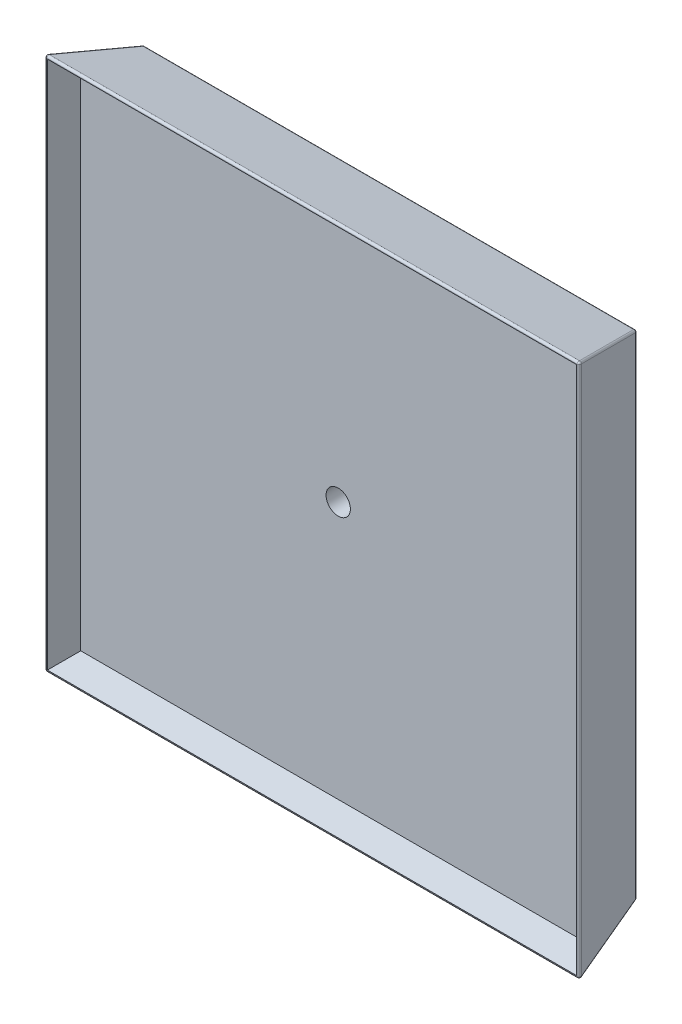
ISO-10303-21;
HEADER;
FILE_DESCRIPTION(('STEP AP214'),'2;1');
FILE_NAME('part.step','',(''),(''),'','','');
FILE_SCHEMA(('AUTOMOTIVE_DESIGN { 1 0 10303 214 1 1 1 1 }'));
ENDSEC;
DATA;
#1=APPLICATION_CONTEXT('core data for automotive mechanical design processes');
#2=APPLICATION_PROTOCOL_DEFINITION('international standard','automotive_design',2000,#1);
#3=PRODUCT_CONTEXT('',#1,'mechanical');
#4=PRODUCT('Part','Part','',(#3));
#5=PRODUCT_RELATED_PRODUCT_CATEGORY('part','',(#4));
#6=PRODUCT_DEFINITION_FORMATION('','',#4);
#7=PRODUCT_DEFINITION_CONTEXT('part definition',#1,'design');
#8=PRODUCT_DEFINITION('design','',#6,#7);
#9=PRODUCT_DEFINITION_SHAPE('','',#8);
#10=(LENGTH_UNIT() NAMED_UNIT(*) SI_UNIT(.MILLI.,.METRE.));
#11=(NAMED_UNIT(*) PLANE_ANGLE_UNIT() SI_UNIT($,.RADIAN.));
#12=(NAMED_UNIT(*) SI_UNIT($,.STERADIAN.) SOLID_ANGLE_UNIT());
#13=UNCERTAINTY_MEASURE_WITH_UNIT(LENGTH_MEASURE(1.E-05),#10,'distance_accuracy_value','');
#14=(GEOMETRIC_REPRESENTATION_CONTEXT(3) GLOBAL_UNCERTAINTY_ASSIGNED_CONTEXT((#13)) GLOBAL_UNIT_ASSIGNED_CONTEXT((#10,
#11,#12)) REPRESENTATION_CONTEXT('',''));
#15=CARTESIAN_POINT('',(0.,0.,0.));
#16=DIRECTION('',(0.,0.,1.));
#17=DIRECTION('',(1.,0.,0.));
#18=AXIS2_PLACEMENT_3D('',#15,#16,#17);
#19=CARTESIAN_POINT('',(526.262083641573,-526.262083641573,3.));
#20=DIRECTION('',(0.965925826289068,0.,-0.258819045102521));
#21=DIRECTION('',(-0.258819045102521,0.,-0.965925826289068));
#22=AXIS2_PLACEMENT_3D('',#19,#20,#21);
#23=PLANE('',#22);
#24=DIRECTION('',(0.,1.,0.));
#25=VECTOR('',#24,1.);
#26=CARTESIAN_POINT('',(526.262083641573,-526.262083641573,3.));
#27=LINE('',#26,#25);
#28=CARTESIAN_POINT('',(526.262083641573,-526.262083641573,3.));
#29=VERTEX_POINT('',#28);
#30=CARTESIAN_POINT('',(526.262083641573,-23.7379163584267,3.));
#31=VERTEX_POINT('',#30);
#32=EDGE_CURVE('E92',#29,#31,#27,.T.);
#33=ORIENTED_EDGE('',*,*,#32,.T.);
#34=DIRECTION('',(-0.250562807085732,-0.250562807085732,-0.935113126531029));
#35=VECTOR('',#34,1.);
#36=CARTESIAN_POINT('',(526.262083641573,-23.7379163584267,3.));
#37=LINE('',#36,#35);
#38=CARTESIAN_POINT('',(539.65954326313,-10.3404567368706,53.));
#39=VERTEX_POINT('',#38);
#40=EDGE_CURVE('E12',#39,#31,#37,.T.);
#41=ORIENTED_EDGE('',*,*,#40,.F.);
#42=DIRECTION('',(0.,-1.,0.));
#43=VECTOR('',#42,1.);
#44=CARTESIAN_POINT('',(539.65954326313,-526.262083641573,53.));
#45=LINE('',#44,#43);
#46=CARTESIAN_POINT('',(539.65954326313,-539.659543263129,53.));
#47=VERTEX_POINT('',#46);
#48=EDGE_CURVE('E111',#47,#39,#45,.F.);
#49=ORIENTED_EDGE('',*,*,#48,.F.);
#50=DIRECTION('',(-0.250562807085732,0.250562807085732,-0.935113126531029));
#51=VECTOR('',#50,1.);
#52=CARTESIAN_POINT('',(526.262083641573,-526.262083641573,3.));
#53=LINE('',#52,#51);
#54=EDGE_CURVE('E103',#47,#29,#53,.T.);
#55=ORIENTED_EDGE('',*,*,#54,.T.);
#56=EDGE_LOOP('',(#33,#41,#49,#55));
#57=FACE_BOUND('',#56,.T.);
#58=ADVANCED_FACE('F45',(#57),#23,.T.);
#59=CARTESIAN_POINT('',(526.262083641573,-23.7379163584267,3.));
#60=DIRECTION('',(0.,0.965925826289068,-0.258819045102521));
#61=DIRECTION('',(0.,0.258819045102521,0.965925826289068));
#62=AXIS2_PLACEMENT_3D('',#59,#60,#61);
#63=PLANE('',#62);
#64=DIRECTION('',(-1.,0.,0.));
#65=VECTOR('',#64,1.);
#66=CARTESIAN_POINT('',(526.262083641573,-23.7379163584267,3.));
#67=LINE('',#66,#65);
#68=CARTESIAN_POINT('',(23.7379163584268,-23.7379163584267,3.));
#69=VERTEX_POINT('',#68);
#70=EDGE_CURVE('E88',#31,#69,#67,.T.);
#71=ORIENTED_EDGE('',*,*,#70,.T.);
#72=DIRECTION('',(0.250562807085732,-0.250562807085732,-0.935113126531029));
#73=VECTOR('',#72,1.);
#74=CARTESIAN_POINT('',(55.2872480701152,-55.2872480701151,-114.743708892865));
#75=LINE('',#74,#73);
#76=CARTESIAN_POINT('',(10.3404567368706,-10.3404567368706,53.));
#77=VERTEX_POINT('',#76);
#78=EDGE_CURVE('E54',#77,#69,#75,.T.);
#79=ORIENTED_EDGE('',*,*,#78,.F.);
#80=DIRECTION('',(1.,0.,0.));
#81=VECTOR('',#80,1.);
#82=CARTESIAN_POINT('',(526.262083641573,-10.3404567368706,53.));
#83=LINE('',#82,#81);
#84=EDGE_CURVE('E99',#39,#77,#83,.F.);
#85=ORIENTED_EDGE('',*,*,#84,.F.);
#86=ORIENTED_EDGE('',*,*,#40,.T.);
#87=EDGE_LOOP('',(#71,#79,#85,#86));
#88=FACE_BOUND('',#87,.T.);
#89=ADVANCED_FACE('F47',(#88),#63,.T.);
#90=CARTESIAN_POINT('',(23.7379163584268,-526.262083641573,3.));
#91=DIRECTION('',(-0.965925826289068,0.,-0.258819045102521));
#92=DIRECTION('',(-0.258819045102521,0.,0.965925826289068));
#93=AXIS2_PLACEMENT_3D('',#90,#91,#92);
#94=PLANE('',#93);
#95=DIRECTION('',(0.,-1.,0.));
#96=VECTOR('',#95,1.);
#97=CARTESIAN_POINT('',(23.7379163584268,-526.262083641573,3.));
#98=LINE('',#97,#96);
#99=CARTESIAN_POINT('',(23.7379163584268,-526.262083641573,3.));
#100=VERTEX_POINT('',#99);
#101=EDGE_CURVE('E93',#69,#100,#98,.T.);
#102=ORIENTED_EDGE('',*,*,#101,.T.);
#103=DIRECTION('',(0.250562807085732,0.250562807085732,-0.935113126531029));
#104=VECTOR('',#103,1.);
#105=CARTESIAN_POINT('',(55.2872480701153,-494.712751929885,-114.743708892865));
#106=LINE('',#105,#104);
#107=CARTESIAN_POINT('',(10.3404567368706,-539.659543263129,53.));
#108=VERTEX_POINT('',#107);
#109=EDGE_CURVE('E114',#108,#100,#106,.T.);
#110=ORIENTED_EDGE('',*,*,#109,.F.);
#111=DIRECTION('',(0.,1.,0.));
#112=VECTOR('',#111,1.);
#113=CARTESIAN_POINT('',(10.3404567368706,-526.262083641573,53.));
#114=LINE('',#113,#112);
#115=EDGE_CURVE('E67',#77,#108,#114,.F.);
#116=ORIENTED_EDGE('',*,*,#115,.F.);
#117=ORIENTED_EDGE('',*,*,#78,.T.);
#118=EDGE_LOOP('',(#102,#110,#116,#117));
#119=FACE_BOUND('',#118,.T.);
#120=ADVANCED_FACE('F122',(#119),#94,.T.);
#121=CARTESIAN_POINT('',(526.262083641573,-526.262083641573,3.));
#122=DIRECTION('',(0.,-0.965925826289068,-0.258819045102521));
#123=DIRECTION('',(0.,0.258819045102521,-0.965925826289068));
#124=AXIS2_PLACEMENT_3D('',#121,#122,#123);
#125=PLANE('',#124);
#126=DIRECTION('',(1.,0.,0.));
#127=VECTOR('',#126,1.);
#128=CARTESIAN_POINT('',(526.262083641573,-526.262083641573,3.));
#129=LINE('',#128,#127);
#130=EDGE_CURVE('E110',#100,#29,#129,.T.);
#131=ORIENTED_EDGE('',*,*,#130,.T.);
#132=ORIENTED_EDGE('',*,*,#54,.F.);
#133=DIRECTION('',(-1.,0.,0.));
#134=VECTOR('',#133,1.);
#135=CARTESIAN_POINT('',(526.262083641573,-539.659543263129,53.));
#136=LINE('',#135,#134);
#137=EDGE_CURVE('E62',#108,#47,#136,.F.);
#138=ORIENTED_EDGE('',*,*,#137,.F.);
#139=ORIENTED_EDGE('',*,*,#109,.T.);
#140=EDGE_LOOP('',(#131,#132,#138,#139));
#141=FACE_BOUND('',#140,.T.);
#142=ADVANCED_FACE('F124',(#141),#125,.T.);
#143=CARTESIAN_POINT('',(0.,0.,53.));
#144=DIRECTION('',(0.,0.,1.));
#145=DIRECTION('',(1.,0.,0.));
#146=AXIS2_PLACEMENT_3D('',#143,#144,#145);
#147=PLANE('',#146);
#148=CARTESIAN_POINT('',(274.970589370448,-274.970589370448,53.));
#149=DIRECTION('',(0.,0.,1.));
#150=DIRECTION('',(1.,0.,0.));
#151=AXIS2_PLACEMENT_3D('',#148,#149,#150);
#152=CIRCLE('',#151,12.5);
#153=CARTESIAN_POINT('',(287.470589370448,-274.970589370448,53.));
#154=VERTEX_POINT('',#153);
#155=EDGE_CURVE('E104',#154,#154,#152,.T.);
#156=ORIENTED_EDGE('',*,*,#155,.F.);
#157=EDGE_LOOP('',(#156));
#158=FACE_BOUND('',#157,.T.);
#159=ORIENTED_EDGE('',*,*,#48,.T.);
#160=ORIENTED_EDGE('',*,*,#84,.T.);
#161=ORIENTED_EDGE('',*,*,#115,.T.);
#162=ORIENTED_EDGE('',*,*,#137,.T.);
#163=EDGE_LOOP('',(#159,#160,#161,#162));
#164=FACE_BOUND('',#163,.T.);
#165=ADVANCED_FACE('F120',(#158,#164),#147,.T.);
#166=CARTESIAN_POINT('',(0.,0.,3.));
#167=DIRECTION('',(0.,0.,1.));
#168=DIRECTION('',(1.,0.,0.));
#169=AXIS2_PLACEMENT_3D('',#166,#167,#168);
#170=PLANE('',#169);
#171=CARTESIAN_POINT('',(274.970589370448,-274.970589370448,3.));
#172=DIRECTION('',(0.,0.,1.));
#173=DIRECTION('',(1.,0.,0.));
#174=AXIS2_PLACEMENT_3D('',#171,#172,#173);
#175=CIRCLE('',#174,12.5);
#176=CARTESIAN_POINT('',(287.470589370448,-274.970589370448,3.));
#177=VERTEX_POINT('',#176);
#178=EDGE_CURVE('E49',#177,#177,#175,.T.);
#179=ORIENTED_EDGE('',*,*,#178,.T.);
#180=EDGE_LOOP('',(#179));
#181=FACE_BOUND('',#180,.T.);
#182=ORIENTED_EDGE('',*,*,#32,.F.);
#183=ORIENTED_EDGE('',*,*,#130,.F.);
#184=ORIENTED_EDGE('',*,*,#101,.F.);
#185=ORIENTED_EDGE('',*,*,#70,.F.);
#186=EDGE_LOOP('',(#182,#183,#184,#185));
#187=FACE_BOUND('',#186,.T.);
#188=ADVANCED_FACE('F89',(#181,#187),#170,.F.);
#189=CARTESIAN_POINT('',(274.970589370448,-274.970589370448,80.));
#190=DIRECTION('',(0.,0.,-1.));
#191=DIRECTION('',(-1.,0.,0.));
#192=AXIS2_PLACEMENT_3D('',#189,#190,#191);
#193=CYLINDRICAL_SURFACE('',#192,12.5);
#194=ORIENTED_EDGE('',*,*,#155,.T.);
#195=EDGE_LOOP('',(#194));
#196=FACE_BOUND('',#195,.T.);
#197=ORIENTED_EDGE('',*,*,#178,.F.);
#198=EDGE_LOOP('',(#197));
#199=FACE_BOUND('',#198,.T.);
#200=ADVANCED_FACE('F140',(#196,#199),#193,.F.);
#201=CLOSED_SHELL('',(#58,#89,#120,#142,#165,#188,#200));
#202=MANIFOLD_SOLID_BREP('B2',#201);
#203=CARTESIAN_POINT('',(0.,0.,80.));
#204=DIRECTION('',(0.,0.,1.));
#205=DIRECTION('',(1.,0.,0.));
#206=AXIS2_PLACEMENT_3D('',#203,#204,#205);
#207=PLANE('',#206);
#208=DIRECTION('',(1.,0.,0.));
#209=VECTOR('',#208,1.);
#210=CARTESIAN_POINT('',(0.,-2.60645074568241,80.));
#211=LINE('',#210,#209);
#212=CARTESIAN_POINT('',(547.393549254318,-2.60645074568241,80.));
#213=VERTEX_POINT('',#212);
#214=CARTESIAN_POINT('',(2.60645074568241,-2.60645074568241,80.));
#215=VERTEX_POINT('',#214);
#216=EDGE_CURVE('E344',#213,#215,#211,.F.);
#217=ORIENTED_EDGE('',*,*,#216,.T.);
#218=DIRECTION('',(0.,1.,0.));
#219=VECTOR('',#218,1.);
#220=CARTESIAN_POINT('',(2.60645074568248,-550.,80.));
#221=LINE('',#220,#219);
#222=CARTESIAN_POINT('',(2.60645074568248,-547.393549254318,80.));
#223=VERTEX_POINT('',#222);
#224=EDGE_CURVE('E351',#215,#223,#221,.F.);
#225=ORIENTED_EDGE('',*,*,#224,.T.);
#226=DIRECTION('',(-1.,0.,0.));
#227=VECTOR('',#226,1.);
#228=CARTESIAN_POINT('',(550.,-547.393549254318,80.));
#229=LINE('',#228,#227);
#230=CARTESIAN_POINT('',(547.393549254318,-547.393549254318,80.));
#231=VERTEX_POINT('',#230);
#232=EDGE_CURVE('E349',#223,#231,#229,.F.);
#233=ORIENTED_EDGE('',*,*,#232,.T.);
#234=DIRECTION('',(0.,-1.,0.));
#235=VECTOR('',#234,1.);
#236=CARTESIAN_POINT('',(547.393549254318,1.10496167620623E-13,80.));
#237=LINE('',#236,#235);
#238=EDGE_CURVE('E346',#231,#213,#237,.F.);
#239=ORIENTED_EDGE('',*,*,#238,.T.);
#240=EDGE_LOOP('',(#217,#225,#233,#239));
#241=FACE_BOUND('',#240,.T.);
#242=DIRECTION('',(0.,-1.,0.));
#243=VECTOR('',#242,1.);
#244=CARTESIAN_POINT('',(3.10582854123025,0.,80.));
#245=LINE('',#244,#243);
#246=CARTESIAN_POINT('',(3.10582854123032,-546.89417145877,80.));
#247=VERTEX_POINT('',#246);
#248=CARTESIAN_POINT('',(3.10582854123025,-3.10582854123025,80.));
#249=VERTEX_POINT('',#248);
#250=EDGE_CURVE('E320',#247,#249,#245,.F.);
#251=ORIENTED_EDGE('',*,*,#250,.T.);
#252=DIRECTION('',(1.,0.,0.));
#253=VECTOR('',#252,1.);
#254=CARTESIAN_POINT('',(0.,-3.10582854123025,80.));
#255=LINE('',#254,#253);
#256=CARTESIAN_POINT('',(546.89417145877,-3.10582854123025,80.));
#257=VERTEX_POINT('',#256);
#258=EDGE_CURVE('E331',#249,#257,#255,.T.);
#259=ORIENTED_EDGE('',*,*,#258,.T.);
#260=DIRECTION('',(0.,-1.,0.));
#261=VECTOR('',#260,1.);
#262=CARTESIAN_POINT('',(546.89417145877,0.,80.));
#263=LINE('',#262,#261);
#264=CARTESIAN_POINT('',(546.89417145877,-546.89417145877,80.));
#265=VERTEX_POINT('',#264);
#266=EDGE_CURVE('E332',#257,#265,#263,.T.);
#267=ORIENTED_EDGE('',*,*,#266,.T.);
#268=DIRECTION('',(-1.,0.,0.));
#269=VECTOR('',#268,1.);
#270=CARTESIAN_POINT('',(0.,-546.89417145877,80.));
#271=LINE('',#270,#269);
#272=EDGE_CURVE('E207',#247,#265,#271,.F.);
#273=ORIENTED_EDGE('',*,*,#272,.F.);
#274=EDGE_LOOP('',(#251,#259,#267,#273));
#275=FACE_BOUND('',#274,.T.);
#276=ADVANCED_FACE('F190',(#241,#275),#207,.T.);
#277=CARTESIAN_POINT('',(0.,0.,80.));
#278=DIRECTION('',(-0.965925826289068,0.,-0.258819045102521));
#279=DIRECTION('',(-0.258819045102521,0.,0.965925826289068));
#280=AXIS2_PLACEMENT_3D('',#277,#278,#279);
#281=PLANE('',#280);
#282=DIRECTION('',(0.,-1.,0.));
#283=VECTOR('',#282,1.);
#284=CARTESIAN_POINT('',(21.0387377178697,0.,1.48236190979496));
#285=LINE('',#284,#283);
#286=CARTESIAN_POINT('',(21.0387377178697,-22.9705893704478,1.48236190979496));
#287=VERTEX_POINT('',#286);
#288=CARTESIAN_POINT('',(21.0387377178697,-527.029410629552,1.48236190979496));
#289=VERTEX_POINT('',#288);
#290=EDGE_CURVE('E356',#287,#289,#285,.T.);
#291=ORIENTED_EDGE('',*,*,#290,.T.);
#292=DIRECTION('',(-0.250562807085732,-0.250562807085732,0.935113126531029));
#293=VECTOR('',#292,1.);
#294=CARTESIAN_POINT('',(34.4086611919721,-513.65948715545,-48.4148717888628));
#295=LINE('',#294,#293);
#296=CARTESIAN_POINT('',(0.674599093104343,-547.393549254318,77.482361909795));
#297=VERTEX_POINT('',#296);
#298=EDGE_CURVE('E361',#289,#297,#295,.T.);
#299=ORIENTED_EDGE('',*,*,#298,.T.);
#300=DIRECTION('',(0.,-1.,0.));
#301=VECTOR('',#300,1.);
#302=CARTESIAN_POINT('',(0.674599093104276,0.,77.482361909795));
#303=LINE('',#302,#301);
#304=CARTESIAN_POINT('',(0.674599093104277,-2.60645074568241,77.482361909795));
#305=VERTEX_POINT('',#304);
#306=EDGE_CURVE('E358',#297,#305,#303,.F.);
#307=ORIENTED_EDGE('',*,*,#306,.T.);
#308=DIRECTION('',(0.250562807085732,-0.250562807085732,-0.935113126531029));
#309=VECTOR('',#308,1.);
#310=CARTESIAN_POINT('',(21.3146504243869,-23.246502076965,0.452641670618783));
#311=LINE('',#310,#309);
#312=EDGE_CURVE('E354',#305,#287,#311,.T.);
#313=ORIENTED_EDGE('',*,*,#312,.T.);
#314=EDGE_LOOP('',(#291,#299,#307,#313));
#315=FACE_BOUND('',#314,.T.);
#316=ADVANCED_FACE('F519',(#315),#281,.T.);
#317=CARTESIAN_POINT('',(0.,-550.,80.));
#318=DIRECTION('',(0.,-0.965925826289068,-0.258819045102521));
#319=DIRECTION('',(0.,0.258819045102521,-0.965925826289068));
#320=AXIS2_PLACEMENT_3D('',#317,#318,#319);
#321=PLANE('',#320);
#322=DIRECTION('',(1.,0.,0.));
#323=VECTOR('',#322,1.);
#324=CARTESIAN_POINT('',(0.,-549.325400906896,77.4823619097949));
#325=LINE('',#324,#323);
#326=CARTESIAN_POINT('',(547.393549254318,-549.325400906896,77.4823619097949));
#327=VERTEX_POINT('',#326);
#328=CARTESIAN_POINT('',(2.60645074568248,-549.325400906896,77.4823619097949));
#329=VERTEX_POINT('',#328);
#330=EDGE_CURVE('E376',#327,#329,#325,.F.);
#331=ORIENTED_EDGE('',*,*,#330,.T.);
#332=DIRECTION('',(-0.250562807085732,-0.250562807085732,0.935113126531029));
#333=VECTOR('',#332,1.);
#334=CARTESIAN_POINT('',(1.81056668247523,-550.121284970103,80.4526416706188));
#335=LINE('',#334,#333);
#336=CARTESIAN_POINT('',(22.9705893704479,-528.96126228213,1.48236190979494));
#337=VERTEX_POINT('',#336);
#338=EDGE_CURVE('E378',#329,#337,#335,.F.);
#339=ORIENTED_EDGE('',*,*,#338,.T.);
#340=DIRECTION('',(1.,0.,0.));
#341=VECTOR('',#340,1.);
#342=CARTESIAN_POINT('',(0.,-528.96126228213,1.48236190979495));
#343=LINE('',#342,#341);
#344=CARTESIAN_POINT('',(527.029410629552,-528.96126228213,1.48236190979493));
#345=VERTEX_POINT('',#344);
#346=EDGE_CURVE('E374',#337,#345,#343,.T.);
#347=ORIENTED_EDGE('',*,*,#346,.T.);
#348=DIRECTION('',(-0.250562807085732,0.250562807085732,-0.935113126531029));
#349=VECTOR('',#348,1.);
#350=CARTESIAN_POINT('',(548.189433317525,-550.121284970103,80.4526416706188));
#351=LINE('',#350,#349);
#352=EDGE_CURVE('E372',#345,#327,#351,.F.);
#353=ORIENTED_EDGE('',*,*,#352,.T.);
#354=EDGE_LOOP('',(#331,#339,#347,#353));
#355=FACE_BOUND('',#354,.T.);
#356=ADVANCED_FACE('F524',(#355),#321,.T.);
#357=CARTESIAN_POINT('',(550.,0.,80.));
#358=DIRECTION('',(0.965925826289068,0.,-0.258819045102521));
#359=DIRECTION('',(-0.258819045102521,0.,-0.965925826289068));
#360=AXIS2_PLACEMENT_3D('',#357,#358,#359);
#361=PLANE('',#360);
#362=DIRECTION('',(0.,-1.,0.));
#363=VECTOR('',#362,1.);
#364=CARTESIAN_POINT('',(549.325400906896,0.,77.4823619097949));
#365=LINE('',#364,#363);
#366=CARTESIAN_POINT('',(549.325400906896,-2.60645074568241,77.4823619097949));
#367=VERTEX_POINT('',#366);
#368=CARTESIAN_POINT('',(549.325400906896,-547.393549254317,77.4823619097949));
#369=VERTEX_POINT('',#368);
#370=EDGE_CURVE('E385',#367,#369,#365,.T.);
#371=ORIENTED_EDGE('',*,*,#370,.T.);
#372=DIRECTION('',(0.250562807085732,-0.250562807085732,0.935113126531029));
#373=VECTOR('',#372,1.);
#374=CARTESIAN_POINT('',(528.685349575613,-526.753497923035,0.452641670618839));
#375=LINE('',#374,#373);
#376=CARTESIAN_POINT('',(528.961262282131,-527.029410629552,1.48236190979491));
#377=VERTEX_POINT('',#376);
#378=EDGE_CURVE('E387',#369,#377,#375,.F.);
#379=ORIENTED_EDGE('',*,*,#378,.T.);
#380=DIRECTION('',(0.,-1.,0.));
#381=VECTOR('',#380,1.);
#382=CARTESIAN_POINT('',(528.96126228213,-21.4359353944899,1.48236190979491));
#383=LINE('',#382,#381);
#384=CARTESIAN_POINT('',(528.96126228213,-22.9705893704478,1.48236190979491));
#385=VERTEX_POINT('',#384);
#386=EDGE_CURVE('E383',#377,#385,#383,.F.);
#387=ORIENTED_EDGE('',*,*,#386,.T.);
#388=DIRECTION('',(-0.250562807085732,-0.250562807085732,-0.935113126531029));
#389=VECTOR('',#388,1.);
#390=CARTESIAN_POINT('',(550.121284970103,-1.81056668247515,80.4526416706188));
#391=LINE('',#390,#389);
#392=EDGE_CURVE('E381',#385,#367,#391,.F.);
#393=ORIENTED_EDGE('',*,*,#392,.T.);
#394=EDGE_LOOP('',(#371,#379,#387,#393));
#395=FACE_BOUND('',#394,.T.);
#396=ADVANCED_FACE('F498',(#395),#361,.T.);
#397=CARTESIAN_POINT('',(0.,0.,80.));
#398=DIRECTION('',(0.,0.965925826289068,-0.258819045102521));
#399=DIRECTION('',(0.,0.258819045102521,0.965925826289068));
#400=AXIS2_PLACEMENT_3D('',#397,#398,#399);
#401=PLANE('',#400);
#402=DIRECTION('',(1.,0.,0.));
#403=VECTOR('',#402,1.);
#404=CARTESIAN_POINT('',(0.,-0.674599093104276,77.482361909795));
#405=LINE('',#404,#403);
#406=CARTESIAN_POINT('',(2.60645074568241,-0.674599093104276,77.482361909795));
#407=VERTEX_POINT('',#406);
#408=CARTESIAN_POINT('',(547.393549254317,-0.674599093104276,77.482361909795));
#409=VERTEX_POINT('',#408);
#410=EDGE_CURVE('E199',#407,#409,#405,.T.);
#411=ORIENTED_EDGE('',*,*,#410,.T.);
#412=DIRECTION('',(-0.250562807085732,-0.250562807085732,-0.935113126531029));
#413=VECTOR('',#412,1.);
#414=CARTESIAN_POINT('',(513.65948715545,-34.408661191972,-48.4148717888627));
#415=LINE('',#414,#413);
#416=CARTESIAN_POINT('',(527.029410629552,-21.0387377178697,1.48236190979496));
#417=VERTEX_POINT('',#416);
#418=EDGE_CURVE('E43',#409,#417,#415,.T.);
#419=ORIENTED_EDGE('',*,*,#418,.T.);
#420=DIRECTION('',(1.,0.,0.));
#421=VECTOR('',#420,1.);
#422=CARTESIAN_POINT('',(21.4359353944899,-21.0387377178697,1.48236190979496));
#423=LINE('',#422,#421);
#424=CARTESIAN_POINT('',(22.9705893704478,-21.0387377178697,1.48236190979496));
#425=VERTEX_POINT('',#424);
#426=EDGE_CURVE('E390',#417,#425,#423,.F.);
#427=ORIENTED_EDGE('',*,*,#426,.T.);
#428=DIRECTION('',(-0.250562807085732,0.250562807085732,0.935113126531029));
#429=VECTOR('',#428,1.);
#430=CARTESIAN_POINT('',(1.81056668247516,0.121284970102978,80.4526416706188));
#431=LINE('',#430,#429);
#432=EDGE_CURVE('E392',#425,#407,#431,.T.);
#433=ORIENTED_EDGE('',*,*,#432,.T.);
#434=EDGE_LOOP('',(#411,#419,#427,#433));
#435=FACE_BOUND('',#434,.T.);
#436=ADVANCED_FACE('F472',(#435),#401,.T.);
#437=CARTESIAN_POINT('',(0.,0.,0.));
#438=DIRECTION('',(0.,0.,1.));
#439=DIRECTION('',(1.,0.,0.));
#440=AXIS2_PLACEMENT_3D('',#437,#438,#439);
#441=PLANE('',#440);
#442=CARTESIAN_POINT('',(274.970589370448,-274.970589370448,0.));
#443=DIRECTION('',(0.,0.,1.));
#444=DIRECTION('',(1.,0.,0.));
#445=AXIS2_PLACEMENT_3D('',#442,#443,#444);
#446=CIRCLE('',#445,12.5);
#447=CARTESIAN_POINT('',(287.470589370448,-274.970589370448,0.));
#448=VERTEX_POINT('',#447);
#449=EDGE_CURVE('E804',#448,#448,#446,.T.);
#450=ORIENTED_EDGE('',*,*,#449,.T.);
#451=EDGE_LOOP('',(#450));
#452=FACE_BOUND('',#451,.T.);
#453=DIRECTION('',(-1.,0.,0.));
#454=VECTOR('',#453,1.);
#455=CARTESIAN_POINT('',(0.,-527.029410629552,0.));
#456=LINE('',#455,#454);
#457=CARTESIAN_POINT('',(527.029410629552,-527.029410629552,0.));
#458=VERTEX_POINT('',#457);
#459=CARTESIAN_POINT('',(22.9705893704479,-527.029410629552,0.));
#460=VERTEX_POINT('',#459);
#461=EDGE_CURVE('E367',#458,#460,#456,.T.);
#462=ORIENTED_EDGE('',*,*,#461,.T.);
#463=DIRECTION('',(0.,1.,0.));
#464=VECTOR('',#463,1.);
#465=CARTESIAN_POINT('',(22.9705893704478,0.,0.));
#466=LINE('',#465,#464);
#467=CARTESIAN_POINT('',(22.9705893704478,-22.9705893704478,0.));
#468=VERTEX_POINT('',#467);
#469=EDGE_CURVE('E369',#460,#468,#466,.T.);
#470=ORIENTED_EDGE('',*,*,#469,.T.);
#471=DIRECTION('',(1.,0.,0.));
#472=VECTOR('',#471,1.);
#473=CARTESIAN_POINT('',(528.56406460551,-22.9705893704478,0.));
#474=LINE('',#473,#472);
#475=CARTESIAN_POINT('',(527.029410629552,-22.9705893704478,0.));
#476=VERTEX_POINT('',#475);
#477=EDGE_CURVE('E363',#468,#476,#474,.T.);
#478=ORIENTED_EDGE('',*,*,#477,.T.);
#479=DIRECTION('',(0.,-1.,0.));
#480=VECTOR('',#479,1.);
#481=CARTESIAN_POINT('',(527.029410629552,-528.56406460551,0.));
#482=LINE('',#481,#480);
#483=EDGE_CURVE('E365',#476,#458,#482,.T.);
#484=ORIENTED_EDGE('',*,*,#483,.T.);
#485=EDGE_LOOP('',(#462,#470,#478,#484));
#486=FACE_BOUND('',#485,.T.);
#487=ADVANCED_FACE('F511',(#452,#486),#441,.F.);
#488=CARTESIAN_POINT('',(527.029410629552,1.06385488424646E-13,2.));
#489=DIRECTION('',(0.,1.,0.));
#490=DIRECTION('',(-1.,0.,0.));
#491=AXIS2_PLACEMENT_3D('',#488,#489,#490);
#492=CYLINDRICAL_SURFACE('',#491,2.);
#493=CARTESIAN_POINT('',(527.029410629552,-22.9705893704478,1.99999999999996));
#494=DIRECTION('',(0.,1.,0.));
#495=DIRECTION('',(0.,0.,1.));
#496=AXIS2_PLACEMENT_3D('',#493,#494,#495);
#497=CIRCLE('',#496,2.);
#498=EDGE_CURVE('E347',#385,#476,#497,.T.);
#499=ORIENTED_EDGE('',*,*,#498,.F.);
#500=ORIENTED_EDGE('',*,*,#386,.F.);
#501=CARTESIAN_POINT('',(527.029410629552,-527.029410629552,2.));
#502=DIRECTION('',(1.14938745233719E-13,-1.,0.));
#503=DIRECTION('',(1.,1.14938745233719E-13,0.));
#504=AXIS2_PLACEMENT_3D('',#501,#502,#503);
#505=CIRCLE('',#504,2.);
#506=EDGE_CURVE('E455',#458,#377,#505,.T.);
#507=ORIENTED_EDGE('',*,*,#506,.F.);
#508=ORIENTED_EDGE('',*,*,#483,.F.);
#509=EDGE_LOOP('',(#499,#500,#507,#508));
#510=FACE_BOUND('',#509,.T.);
#511=ADVANCED_FACE('F192',(#510),#492,.T.);
#512=CARTESIAN_POINT('',(527.029410629552,-22.9705893704478,1.99999999999999));
#513=DIRECTION('',(0.,0.,1.));
#514=DIRECTION('',(1.,0.,0.));
#515=AXIS2_PLACEMENT_3D('',#512,#513,#514);
#516=SPHERICAL_SURFACE('',#515,2.);
#517=CARTESIAN_POINT('',(527.029410629552,-22.9705893704478,2.00000000000001));
#518=DIRECTION('',(-0.250562807085756,-0.250562807085731,-0.935113126531023));
#519=DIRECTION('',(-0.965925826289062,0.,0.258819045102546));
#520=AXIS2_PLACEMENT_3D('',#517,#518,#519);
#521=CIRCLE('',#520,2.);
#522=EDGE_CURVE('E449',#385,#417,#521,.F.);
#523=ORIENTED_EDGE('',*,*,#522,.F.);
#524=ORIENTED_EDGE('',*,*,#498,.T.);
#525=CARTESIAN_POINT('',(527.029410629552,-22.9705893704478,2.));
#526=DIRECTION('',(1.,0.,0.));
#527=DIRECTION('',(0.,1.,0.));
#528=AXIS2_PLACEMENT_3D('',#525,#526,#527);
#529=CIRCLE('',#528,2.);
#530=EDGE_CURVE('E452',#417,#476,#529,.F.);
#531=ORIENTED_EDGE('',*,*,#530,.F.);
#532=EDGE_LOOP('',(#523,#524,#531));
#533=FACE_BOUND('',#532,.T.);
#534=ADVANCED_FACE('F462',(#533),#516,.T.);
#535=CARTESIAN_POINT('',(527.029410629552,-527.029410629552,1.99999999999998));
#536=DIRECTION('',(0.,0.,1.));
#537=DIRECTION('',(1.,0.,0.));
#538=AXIS2_PLACEMENT_3D('',#535,#536,#537);
#539=SPHERICAL_SURFACE('',#538,2.);
#540=CARTESIAN_POINT('',(527.029410629552,-527.029410629552,1.99999999999999));
#541=DIRECTION('',(1.,0.,0.));
#542=DIRECTION('',(0.,0.,-1.));
#543=AXIS2_PLACEMENT_3D('',#540,#541,#542);
#544=CIRCLE('',#543,2.);
#545=EDGE_CURVE('E444',#458,#345,#544,.F.);
#546=ORIENTED_EDGE('',*,*,#545,.F.);
#547=ORIENTED_EDGE('',*,*,#506,.T.);
#548=CARTESIAN_POINT('',(527.029410629552,-527.029410629552,1.99999999999994));
#549=DIRECTION('',(-0.250562807085734,0.250562807085691,-0.93511312653104));
#550=DIRECTION('',(-0.965925826289068,0.,0.258819045102521));
#551=AXIS2_PLACEMENT_3D('',#548,#549,#550);
#552=CIRCLE('',#551,2.);
#553=EDGE_CURVE('E447',#345,#377,#552,.F.);
#554=ORIENTED_EDGE('',*,*,#553,.F.);
#555=EDGE_LOOP('',(#546,#547,#554));
#556=FACE_BOUND('',#555,.T.);
#557=ADVANCED_FACE('F508',(#556),#539,.T.);
#558=CARTESIAN_POINT('',(0.,-22.9705893704478,2.));
#559=DIRECTION('',(-1.,0.,0.));
#560=DIRECTION('',(0.,0.,1.));
#561=AXIS2_PLACEMENT_3D('',#558,#559,#560);
#562=CYLINDRICAL_SURFACE('',#561,2.);
#563=ORIENTED_EDGE('',*,*,#530,.T.);
#564=ORIENTED_EDGE('',*,*,#477,.F.);
#565=CARTESIAN_POINT('',(22.9705893704478,-22.9705893704478,2.));
#566=DIRECTION('',(-1.,0.,0.));
#567=DIRECTION('',(0.,0.,1.));
#568=AXIS2_PLACEMENT_3D('',#565,#566,#567);
#569=CIRCLE('',#568,2.);
#570=EDGE_CURVE('E439',#425,#468,#569,.T.);
#571=ORIENTED_EDGE('',*,*,#570,.F.);
#572=ORIENTED_EDGE('',*,*,#426,.F.);
#573=EDGE_LOOP('',(#563,#564,#571,#572));
#574=FACE_BOUND('',#573,.T.);
#575=ADVANCED_FACE('F469',(#574),#562,.T.);
#576=CARTESIAN_POINT('',(513.65948715545,-36.3405128445501,-47.8972336986576));
#577=DIRECTION('',(-0.250562807085732,-0.250562807085732,-0.935113126531029));
#578=DIRECTION('',(0.,0.965925826289068,-0.258819045102521));
#579=AXIS2_PLACEMENT_3D('',#576,#577,#578);
#580=CYLINDRICAL_SURFACE('',#579,2.);
#581=ORIENTED_EDGE('',*,*,#522,.T.);
#582=ORIENTED_EDGE('',*,*,#418,.F.);
#583=CARTESIAN_POINT('',(547.393549254318,-2.60645074568241,78.));
#584=DIRECTION('',(0.250562807085729,0.250562807085744,0.935113126531027));
#585=DIRECTION('',(0.,-0.965925826289065,0.258819045102534));
#586=AXIS2_PLACEMENT_3D('',#583,#584,#585);
#587=CIRCLE('',#586,2.);
#588=EDGE_CURVE('E436',#367,#409,#587,.T.);
#589=ORIENTED_EDGE('',*,*,#588,.F.);
#590=ORIENTED_EDGE('',*,*,#392,.F.);
#591=EDGE_LOOP('',(#581,#582,#589,#590));
#592=FACE_BOUND('',#591,.T.);
#593=ADVANCED_FACE('F476',(#592),#580,.T.);
#594=CARTESIAN_POINT('',(547.393549254318,0.,78.));
#595=DIRECTION('',(0.,-1.,0.));
#596=DIRECTION('',(1.,0.,0.));
#597=AXIS2_PLACEMENT_3D('',#594,#595,#596);
#598=CYLINDRICAL_SURFACE('',#597,2.);
#599=CARTESIAN_POINT('',(547.393549254318,-547.393549254317,78.));
#600=DIRECTION('',(0.,-1.,-1.11022302462515E-13));
#601=DIRECTION('',(0.,1.11022302462515E-13,-1.));
#602=AXIS2_PLACEMENT_3D('',#599,#600,#601);
#603=CIRCLE('',#602,2.);
#604=EDGE_CURVE('E430',#369,#231,#603,.T.);
#605=ORIENTED_EDGE('',*,*,#604,.F.);
#606=ORIENTED_EDGE('',*,*,#370,.F.);
#607=CARTESIAN_POINT('',(547.393549254318,-2.60645074568241,78.));
#608=DIRECTION('',(0.,1.,0.));
#609=DIRECTION('',(-1.,0.,0.));
#610=AXIS2_PLACEMENT_3D('',#607,#608,#609);
#611=CIRCLE('',#610,2.);
#612=EDGE_CURVE('E433',#213,#367,#611,.T.);
#613=ORIENTED_EDGE('',*,*,#612,.F.);
#614=ORIENTED_EDGE('',*,*,#238,.F.);
#615=EDGE_LOOP('',(#605,#606,#613,#614));
#616=FACE_BOUND('',#615,.T.);
#617=ADVANCED_FACE('F495',(#616),#598,.T.);
#618=CARTESIAN_POINT('',(513.65948715545,-513.65948715545,-47.8972336986577));
#619=DIRECTION('',(-0.250562807085732,0.250562807085732,-0.935113126531029));
#620=DIRECTION('',(-0.965925826289068,0.,0.258819045102521));
#621=AXIS2_PLACEMENT_3D('',#618,#619,#620);
#622=CYLINDRICAL_SURFACE('',#621,2.);
#623=ORIENTED_EDGE('',*,*,#553,.T.);
#624=ORIENTED_EDGE('',*,*,#378,.F.);
#625=CARTESIAN_POINT('',(547.393549254318,-547.393549254318,78.));
#626=DIRECTION('',(0.250562807085757,-0.250562807085728,0.935113126531024));
#627=DIRECTION('',(0.965925826289061,0.,-0.258819045102546));
#628=AXIS2_PLACEMENT_3D('',#625,#626,#627);
#629=CIRCLE('',#628,2.);
#630=EDGE_CURVE('E427',#327,#369,#629,.T.);
#631=ORIENTED_EDGE('',*,*,#630,.F.);
#632=ORIENTED_EDGE('',*,*,#352,.F.);
#633=EDGE_LOOP('',(#623,#624,#631,#632));
#634=FACE_BOUND('',#633,.T.);
#635=ADVANCED_FACE('F501',(#634),#622,.T.);
#636=CARTESIAN_POINT('',(0.,-527.029410629552,2.));
#637=DIRECTION('',(-1.,0.,0.));
#638=DIRECTION('',(0.,0.,1.));
#639=AXIS2_PLACEMENT_3D('',#636,#637,#638);
#640=CYLINDRICAL_SURFACE('',#639,2.);
#641=ORIENTED_EDGE('',*,*,#545,.T.);
#642=ORIENTED_EDGE('',*,*,#346,.F.);
#643=CARTESIAN_POINT('',(22.9705893704479,-527.029410629552,2.));
#644=DIRECTION('',(-1.,0.,0.));
#645=DIRECTION('',(0.,-1.,0.));
#646=AXIS2_PLACEMENT_3D('',#643,#644,#645);
#647=CIRCLE('',#646,2.);
#648=EDGE_CURVE('E424',#460,#337,#647,.T.);
#649=ORIENTED_EDGE('',*,*,#648,.F.);
#650=ORIENTED_EDGE('',*,*,#461,.F.);
#651=EDGE_LOOP('',(#641,#642,#649,#650));
#652=FACE_BOUND('',#651,.T.);
#653=ADVANCED_FACE('F580',(#652),#640,.T.);
#654=CARTESIAN_POINT('',(22.9705893704478,0.,2.));
#655=DIRECTION('',(0.,1.,0.));
#656=DIRECTION('',(-1.,0.,0.));
#657=AXIS2_PLACEMENT_3D('',#654,#655,#656);
#658=CYLINDRICAL_SURFACE('',#657,2.);
#659=CARTESIAN_POINT('',(22.9705893704478,-22.9705893704478,2.));
#660=DIRECTION('',(0.,1.,0.));
#661=DIRECTION('',(-1.,0.,0.));
#662=AXIS2_PLACEMENT_3D('',#659,#660,#661);
#663=CIRCLE('',#662,2.);
#664=EDGE_CURVE('E441',#468,#287,#663,.T.);
#665=ORIENTED_EDGE('',*,*,#664,.F.);
#666=ORIENTED_EDGE('',*,*,#469,.F.);
#667=CARTESIAN_POINT('',(22.9705893704479,-527.029410629552,2.));
#668=DIRECTION('',(0.,-1.,0.));
#669=DIRECTION('',(0.,0.,-1.));
#670=AXIS2_PLACEMENT_3D('',#667,#668,#669);
#671=CIRCLE('',#670,2.);
#672=EDGE_CURVE('E421',#289,#460,#671,.T.);
#673=ORIENTED_EDGE('',*,*,#672,.F.);
#674=ORIENTED_EDGE('',*,*,#290,.F.);
#675=EDGE_LOOP('',(#665,#666,#673,#674));
#676=FACE_BOUND('',#675,.T.);
#677=ADVANCED_FACE('F576',(#676),#658,.T.);
#678=CARTESIAN_POINT('',(22.9705893704478,-22.9705893704478,2.));
#679=DIRECTION('',(0.,0.,1.));
#680=DIRECTION('',(1.,0.,0.));
#681=AXIS2_PLACEMENT_3D('',#678,#679,#680);
#682=SPHERICAL_SURFACE('',#681,2.);
#683=ORIENTED_EDGE('',*,*,#570,.T.);
#684=ORIENTED_EDGE('',*,*,#664,.T.);
#685=CARTESIAN_POINT('',(22.9705893704478,-22.9705893704478,2.));
#686=DIRECTION('',(0.250562807085732,-0.250562807085733,-0.935113126531029));
#687=DIRECTION('',(0.,0.965925826289068,-0.258819045102522));
#688=AXIS2_PLACEMENT_3D('',#685,#686,#687);
#689=CIRCLE('',#688,2.);
#690=EDGE_CURVE('E418',#425,#287,#689,.F.);
#691=ORIENTED_EDGE('',*,*,#690,.F.);
#692=EDGE_LOOP('',(#683,#684,#691));
#693=FACE_BOUND('',#692,.T.);
#694=ADVANCED_FACE('F573',(#693),#682,.T.);
#695=CARTESIAN_POINT('',(547.393549254318,-2.60645074568241,78.));
#696=DIRECTION('',(0.,0.,1.));
#697=DIRECTION('',(1.,0.,0.));
#698=AXIS2_PLACEMENT_3D('',#695,#696,#697);
#699=SPHERICAL_SURFACE('',#698,2.);
#700=ORIENTED_EDGE('',*,*,#612,.T.);
#701=ORIENTED_EDGE('',*,*,#588,.T.);
#702=CARTESIAN_POINT('',(547.393549254317,-2.60645074568241,78.));
#703=DIRECTION('',(1.,0.,0.));
#704=DIRECTION('',(0.,0.,-1.));
#705=AXIS2_PLACEMENT_3D('',#702,#703,#704);
#706=CIRCLE('',#705,2.);
#707=EDGE_CURVE('E415',#213,#409,#706,.F.);
#708=ORIENTED_EDGE('',*,*,#707,.F.);
#709=EDGE_LOOP('',(#700,#701,#708));
#710=FACE_BOUND('',#709,.T.);
#711=ADVANCED_FACE('F479',(#710),#699,.T.);
#712=CARTESIAN_POINT('',(547.393549254318,-547.393549254318,78.));
#713=DIRECTION('',(0.,0.,1.));
#714=DIRECTION('',(1.,0.,0.));
#715=AXIS2_PLACEMENT_3D('',#712,#713,#714);
#716=SPHERICAL_SURFACE('',#715,2.);
#717=ORIENTED_EDGE('',*,*,#630,.T.);
#718=ORIENTED_EDGE('',*,*,#604,.T.);
#719=CARTESIAN_POINT('',(547.393549254318,-547.393549254318,78.));
#720=DIRECTION('',(1.,0.,0.));
#721=DIRECTION('',(0.,0.,-1.));
#722=AXIS2_PLACEMENT_3D('',#719,#720,#721);
#723=CIRCLE('',#722,2.);
#724=EDGE_CURVE('E412',#327,#231,#723,.F.);
#725=ORIENTED_EDGE('',*,*,#724,.F.);
#726=EDGE_LOOP('',(#717,#718,#725));
#727=FACE_BOUND('',#726,.T.);
#728=ADVANCED_FACE('F566',(#727),#716,.T.);
#729=CARTESIAN_POINT('',(22.9705893704479,-527.029410629552,2.));
#730=DIRECTION('',(0.,0.,1.));
#731=DIRECTION('',(1.,0.,0.));
#732=AXIS2_PLACEMENT_3D('',#729,#730,#731);
#733=SPHERICAL_SURFACE('',#732,2.);
#734=ORIENTED_EDGE('',*,*,#672,.T.);
#735=ORIENTED_EDGE('',*,*,#648,.T.);
#736=CARTESIAN_POINT('',(22.9705893704479,-527.029410629552,1.99999999999998));
#737=DIRECTION('',(0.250562807085721,0.250562807085732,-0.935113126531032));
#738=DIRECTION('',(0.,0.965925826289068,0.258819045102521));
#739=AXIS2_PLACEMENT_3D('',#736,#737,#738);
#740=CIRCLE('',#739,2.);
#741=EDGE_CURVE('E410',#289,#337,#740,.F.);
#742=ORIENTED_EDGE('',*,*,#741,.F.);
#743=EDGE_LOOP('',(#734,#735,#742));
#744=FACE_BOUND('',#743,.T.);
#745=ADVANCED_FACE('F562',(#744),#733,.T.);
#746=CARTESIAN_POINT('',(1.81056668247516,-1.81056668247516,80.9702797608238));
#747=DIRECTION('',(0.250562807085732,-0.250562807085732,-0.935113126531029));
#748=DIRECTION('',(-0.965925826289068,0.,-0.258819045102521));
#749=AXIS2_PLACEMENT_3D('',#746,#747,#748);
#750=CYLINDRICAL_SURFACE('',#749,2.);
#751=ORIENTED_EDGE('',*,*,#690,.T.);
#752=ORIENTED_EDGE('',*,*,#312,.F.);
#753=CARTESIAN_POINT('',(2.60645074568241,-2.60645074568241,78.));
#754=DIRECTION('',(-0.250562807085731,0.25056280708573,0.93511312653103));
#755=DIRECTION('',(0.965925826289069,0.,0.25881904510252));
#756=AXIS2_PLACEMENT_3D('',#753,#754,#755);
#757=CIRCLE('',#756,2.);
#758=EDGE_CURVE('E407',#407,#305,#757,.T.);
#759=ORIENTED_EDGE('',*,*,#758,.F.);
#760=ORIENTED_EDGE('',*,*,#432,.F.);
#761=EDGE_LOOP('',(#751,#752,#759,#760));
#762=FACE_BOUND('',#761,.T.);
#763=ADVANCED_FACE('F559',(#762),#750,.T.);
#764=CARTESIAN_POINT('',(0.,-2.60645074568241,78.));
#765=DIRECTION('',(1.,0.,0.));
#766=DIRECTION('',(0.,0.,-1.));
#767=AXIS2_PLACEMENT_3D('',#764,#765,#766);
#768=CYLINDRICAL_SURFACE('',#767,2.);
#769=ORIENTED_EDGE('',*,*,#707,.T.);
#770=ORIENTED_EDGE('',*,*,#410,.F.);
#771=CARTESIAN_POINT('',(2.60645074568241,-2.60645074568241,78.));
#772=DIRECTION('',(-1.,0.,0.));
#773=DIRECTION('',(0.,-1.,0.));
#774=AXIS2_PLACEMENT_3D('',#771,#772,#773);
#775=CIRCLE('',#774,2.);
#776=EDGE_CURVE('E404',#215,#407,#775,.T.);
#777=ORIENTED_EDGE('',*,*,#776,.F.);
#778=ORIENTED_EDGE('',*,*,#216,.F.);
#779=EDGE_LOOP('',(#769,#770,#777,#778));
#780=FACE_BOUND('',#779,.T.);
#781=ADVANCED_FACE('F483',(#780),#768,.T.);
#782=CARTESIAN_POINT('',(0.,-547.393549254318,78.));
#783=DIRECTION('',(1.,0.,0.));
#784=DIRECTION('',(0.,0.,-1.));
#785=AXIS2_PLACEMENT_3D('',#782,#783,#784);
#786=CYLINDRICAL_SURFACE('',#785,2.);
#787=ORIENTED_EDGE('',*,*,#724,.T.);
#788=ORIENTED_EDGE('',*,*,#232,.F.);
#789=CARTESIAN_POINT('',(2.60645074568248,-547.393549254318,78.));
#790=DIRECTION('',(-1.,0.,0.));
#791=DIRECTION('',(0.,0.,1.));
#792=AXIS2_PLACEMENT_3D('',#789,#790,#791);
#793=CIRCLE('',#792,2.);
#794=EDGE_CURVE('E401',#329,#223,#793,.T.);
#795=ORIENTED_EDGE('',*,*,#794,.F.);
#796=ORIENTED_EDGE('',*,*,#330,.F.);
#797=EDGE_LOOP('',(#787,#788,#795,#796));
#798=FACE_BOUND('',#797,.T.);
#799=ADVANCED_FACE('F552',(#798),#786,.T.);
#800=CARTESIAN_POINT('',(1.81056668247522,-548.189433317525,80.9702797608238));
#801=DIRECTION('',(0.250562807085732,0.250562807085732,-0.935113126531029));
#802=DIRECTION('',(-0.965925826289068,0.,-0.258819045102521));
#803=AXIS2_PLACEMENT_3D('',#800,#801,#802);
#804=CYLINDRICAL_SURFACE('',#803,2.);
#805=ORIENTED_EDGE('',*,*,#741,.T.);
#806=ORIENTED_EDGE('',*,*,#338,.F.);
#807=CARTESIAN_POINT('',(2.60645074568248,-547.393549254318,78.));
#808=DIRECTION('',(-0.25056280708573,-0.25056280708573,0.93511312653103));
#809=DIRECTION('',(0.965925826289069,0.,0.258819045102519));
#810=AXIS2_PLACEMENT_3D('',#807,#808,#809);
#811=CIRCLE('',#810,2.);
#812=EDGE_CURVE('E398',#297,#329,#811,.T.);
#813=ORIENTED_EDGE('',*,*,#812,.F.);
#814=ORIENTED_EDGE('',*,*,#298,.F.);
#815=EDGE_LOOP('',(#805,#806,#813,#814));
#816=FACE_BOUND('',#815,.T.);
#817=ADVANCED_FACE('F548',(#816),#804,.T.);
#818=CARTESIAN_POINT('',(2.60645074568241,-2.60645074568241,78.));
#819=DIRECTION('',(0.,0.,1.));
#820=DIRECTION('',(1.,0.,0.));
#821=AXIS2_PLACEMENT_3D('',#818,#819,#820);
#822=SPHERICAL_SURFACE('',#821,2.);
#823=ORIENTED_EDGE('',*,*,#776,.T.);
#824=ORIENTED_EDGE('',*,*,#758,.T.);
#825=CARTESIAN_POINT('',(2.60645074568241,-2.60645074568241,78.));
#826=DIRECTION('',(0.,1.,0.));
#827=DIRECTION('',(0.,0.,1.));
#828=AXIS2_PLACEMENT_3D('',#825,#826,#827);
#829=CIRCLE('',#828,2.);
#830=EDGE_CURVE('E396',#215,#305,#829,.F.);
#831=ORIENTED_EDGE('',*,*,#830,.F.);
#832=EDGE_LOOP('',(#823,#824,#831));
#833=FACE_BOUND('',#832,.T.);
#834=ADVANCED_FACE('F544',(#833),#822,.T.);
#835=CARTESIAN_POINT('',(2.60645074568248,-547.393549254318,78.));
#836=DIRECTION('',(0.,0.,1.));
#837=DIRECTION('',(1.,0.,0.));
#838=AXIS2_PLACEMENT_3D('',#835,#836,#837);
#839=SPHERICAL_SURFACE('',#838,2.);
#840=ORIENTED_EDGE('',*,*,#812,.T.);
#841=ORIENTED_EDGE('',*,*,#794,.T.);
#842=CARTESIAN_POINT('',(2.60645074568248,-547.393549254318,78.));
#843=DIRECTION('',(0.,-1.,0.));
#844=DIRECTION('',(0.,0.,-1.));
#845=AXIS2_PLACEMENT_3D('',#842,#843,#844);
#846=CIRCLE('',#845,2.);
#847=EDGE_CURVE('E339',#297,#223,#846,.F.);
#848=ORIENTED_EDGE('',*,*,#847,.F.);
#849=EDGE_LOOP('',(#840,#841,#848));
#850=FACE_BOUND('',#849,.T.);
#851=ADVANCED_FACE('F540',(#850),#839,.T.);
#852=CARTESIAN_POINT('',(2.60645074568241,0.,78.));
#853=DIRECTION('',(0.,-1.,0.));
#854=DIRECTION('',(1.,0.,0.));
#855=AXIS2_PLACEMENT_3D('',#852,#853,#854);
#856=CYLINDRICAL_SURFACE('',#855,2.);
#857=ORIENTED_EDGE('',*,*,#830,.T.);
#858=ORIENTED_EDGE('',*,*,#306,.F.);
#859=ORIENTED_EDGE('',*,*,#847,.T.);
#860=ORIENTED_EDGE('',*,*,#224,.F.);
#861=EDGE_LOOP('',(#857,#858,#859,#860));
#862=FACE_BOUND('',#861,.T.);
#863=ADVANCED_FACE('F537',(#862),#856,.T.);
#864=CARTESIAN_POINT('',(2.8977774788672,0.,80.7764571353076));
#865=DIRECTION('',(-0.965925826289068,0.,-0.258819045102521));
#866=DIRECTION('',(-0.258819045102521,0.,0.965925826289068));
#867=AXIS2_PLACEMENT_3D('',#864,#865,#866);
#868=PLANE('',#867);
#869=DIRECTION('',(0.,-1.,0.));
#870=VECTOR('',#869,1.);
#871=CARTESIAN_POINT('',(23.7379163584268,0.,3.));
#872=LINE('',#871,#870);
#873=CARTESIAN_POINT('',(23.7379163584268,-526.262083641573,3.));
#874=VERTEX_POINT('',#873);
#875=CARTESIAN_POINT('',(23.7379163584268,-23.7379163584267,3.));
#876=VERTEX_POINT('',#875);
#877=EDGE_CURVE('E304',#874,#876,#872,.F.);
#878=ORIENTED_EDGE('',*,*,#877,.T.);
#879=DIRECTION('',(-0.250562807085732,0.250562807085732,0.935113126531029));
#880=VECTOR('',#879,1.);
#881=CARTESIAN_POINT('',(2.71585002371274,-2.71585002371274,81.4554196412357));
#882=LINE('',#881,#880);
#883=EDGE_CURVE('E329',#249,#876,#882,.F.);
#884=ORIENTED_EDGE('',*,*,#883,.F.);
#885=ORIENTED_EDGE('',*,*,#250,.F.);
#886=DIRECTION('',(0.250562807085732,0.250562807085732,-0.935113126531029));
#887=VECTOR('',#886,1.);
#888=CARTESIAN_POINT('',(2.7158500237128,-547.284149976287,81.4554196412357));
#889=LINE('',#888,#887);
#890=EDGE_CURVE('E317',#247,#874,#889,.T.);
#891=ORIENTED_EDGE('',*,*,#890,.T.);
#892=EDGE_LOOP('',(#878,#884,#885,#891));
#893=FACE_BOUND('',#892,.T.);
#894=ADVANCED_FACE('F318',(#893),#868,.F.);
#895=CARTESIAN_POINT('',(0.,-547.102222521133,80.7764571353076));
#896=DIRECTION('',(0.,-0.965925826289068,-0.258819045102521));
#897=DIRECTION('',(0.,0.258819045102521,-0.965925826289068));
#898=AXIS2_PLACEMENT_3D('',#895,#896,#897);
#899=PLANE('',#898);
#900=ORIENTED_EDGE('',*,*,#272,.T.);
#901=DIRECTION('',(0.250562807085732,-0.250562807085732,0.935113126531029));
#902=VECTOR('',#901,1.);
#903=CARTESIAN_POINT('',(512.754203814212,-512.754203814212,-47.4120938182458));
#904=LINE('',#903,#902);
#905=CARTESIAN_POINT('',(526.262083641573,-526.262083641573,3.));
#906=VERTEX_POINT('',#905);
#907=EDGE_CURVE('E324',#265,#906,#904,.F.);
#908=ORIENTED_EDGE('',*,*,#907,.T.);
#909=DIRECTION('',(-1.,0.,0.));
#910=VECTOR('',#909,1.);
#911=CARTESIAN_POINT('',(0.,-526.262083641573,3.));
#912=LINE('',#911,#910);
#913=EDGE_CURVE('E309',#874,#906,#912,.F.);
#914=ORIENTED_EDGE('',*,*,#913,.F.);
#915=ORIENTED_EDGE('',*,*,#890,.F.);
#916=EDGE_LOOP('',(#900,#908,#914,#915));
#917=FACE_BOUND('',#916,.T.);
#918=ADVANCED_FACE('F323',(#917),#899,.F.);
#919=CARTESIAN_POINT('',(547.102222521133,0.,80.7764571353076));
#920=DIRECTION('',(0.965925826289068,0.,-0.258819045102521));
#921=DIRECTION('',(-0.258819045102521,0.,-0.965925826289068));
#922=AXIS2_PLACEMENT_3D('',#919,#920,#921);
#923=PLANE('',#922);
#924=ORIENTED_EDGE('',*,*,#266,.F.);
#925=DIRECTION('',(-0.250562807085732,-0.250562807085732,-0.935113126531029));
#926=VECTOR('',#925,1.);
#927=CARTESIAN_POINT('',(512.754203814212,-37.2457961857877,-47.4120938182457));
#928=LINE('',#927,#926);
#929=CARTESIAN_POINT('',(526.262083641573,-23.7379163584267,3.));
#930=VERTEX_POINT('',#929);
#931=EDGE_CURVE('E334',#257,#930,#928,.T.);
#932=ORIENTED_EDGE('',*,*,#931,.T.);
#933=DIRECTION('',(0.,1.,0.));
#934=VECTOR('',#933,1.);
#935=CARTESIAN_POINT('',(526.262083641573,1.06230596772015E-13,3.));
#936=LINE('',#935,#934);
#937=EDGE_CURVE('E321',#906,#930,#936,.T.);
#938=ORIENTED_EDGE('',*,*,#937,.F.);
#939=ORIENTED_EDGE('',*,*,#907,.F.);
#940=EDGE_LOOP('',(#924,#932,#938,#939));
#941=FACE_BOUND('',#940,.T.);
#942=ADVANCED_FACE('F678',(#941),#923,.F.);
#943=CARTESIAN_POINT('',(0.,-2.8977774788672,80.7764571353076));
#944=DIRECTION('',(0.,0.965925826289068,-0.258819045102521));
#945=DIRECTION('',(0.,0.258819045102521,0.965925826289068));
#946=AXIS2_PLACEMENT_3D('',#943,#944,#945);
#947=PLANE('',#946);
#948=ORIENTED_EDGE('',*,*,#258,.F.);
#949=ORIENTED_EDGE('',*,*,#883,.T.);
#950=DIRECTION('',(1.,0.,0.));
#951=VECTOR('',#950,1.);
#952=CARTESIAN_POINT('',(0.,-23.7379163584267,3.));
#953=LINE('',#952,#951);
#954=EDGE_CURVE('E311',#876,#930,#953,.T.);
#955=ORIENTED_EDGE('',*,*,#954,.T.);
#956=ORIENTED_EDGE('',*,*,#931,.F.);
#957=EDGE_LOOP('',(#948,#949,#955,#956));
#958=FACE_BOUND('',#957,.T.);
#959=ADVANCED_FACE('F685',(#958),#947,.F.);
#960=CARTESIAN_POINT('',(0.,0.,3.));
#961=DIRECTION('',(0.,0.,1.));
#962=DIRECTION('',(1.,0.,0.));
#963=AXIS2_PLACEMENT_3D('',#960,#961,#962);
#964=PLANE('',#963);
#965=CARTESIAN_POINT('',(274.970589370448,-274.970589370448,3.));
#966=DIRECTION('',(0.,0.,1.));
#967=DIRECTION('',(1.,0.,0.));
#968=AXIS2_PLACEMENT_3D('',#965,#966,#967);
#969=CIRCLE('',#968,12.5);
#970=CARTESIAN_POINT('',(287.470589370448,-274.970589370448,3.));
#971=VERTEX_POINT('',#970);
#972=EDGE_CURVE('E194',#971,#971,#969,.T.);
#973=ORIENTED_EDGE('',*,*,#972,.F.);
#974=EDGE_LOOP('',(#973));
#975=FACE_BOUND('',#974,.T.);
#976=ORIENTED_EDGE('',*,*,#913,.T.);
#977=ORIENTED_EDGE('',*,*,#937,.T.);
#978=ORIENTED_EDGE('',*,*,#954,.F.);
#979=ORIENTED_EDGE('',*,*,#877,.F.);
#980=EDGE_LOOP('',(#976,#977,#978,#979));
#981=FACE_BOUND('',#980,.T.);
#982=ADVANCED_FACE('F306',(#975,#981),#964,.T.);
#983=CARTESIAN_POINT('',(274.970589370448,-274.970589370448,80.));
#984=DIRECTION('',(0.,0.,-1.));
#985=DIRECTION('',(-1.,0.,0.));
#986=AXIS2_PLACEMENT_3D('',#983,#984,#985);
#987=CYLINDRICAL_SURFACE('',#986,12.5);
#988=ORIENTED_EDGE('',*,*,#972,.T.);
#989=EDGE_LOOP('',(#988));
#990=FACE_BOUND('',#989,.T.);
#991=ORIENTED_EDGE('',*,*,#449,.F.);
#992=EDGE_LOOP('',(#991));
#993=FACE_BOUND('',#992,.T.);
#994=ADVANCED_FACE('F700',(#990,#993),#987,.F.);
#995=CLOSED_SHELL('',(#276,#316,#356,#396,#436,#487,#511,#534,#557,#575,#593,#617,#635,#653,
#677,#694,#711,#728,#745,#763,#781,#799,#817,#834,#851,#863,#894,#918,#942,#959,#982,#994));
#996=MANIFOLD_SOLID_BREP('B6',#995);
#997=ADVANCED_BREP_SHAPE_REPRESENTATION('',(#18,#202,#996),#14);
#998=SHAPE_DEFINITION_REPRESENTATION(#9,#997);
ENDSEC;
END-ISO-10303-21;
